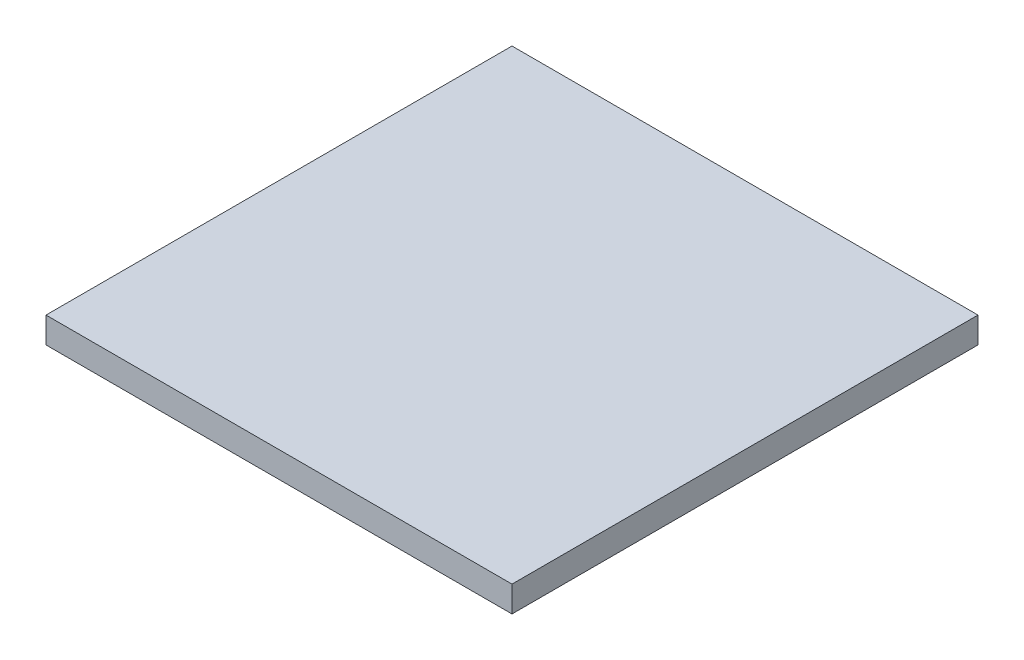
ISO-10303-21;
HEADER;
FILE_DESCRIPTION(('STEP AP214'),'2;1');
FILE_NAME('part.step','',(''),(''),'','','');
FILE_SCHEMA(('AUTOMOTIVE_DESIGN { 1 0 10303 214 1 1 1 1 }'));
ENDSEC;
DATA;
#1=APPLICATION_CONTEXT('core data for automotive mechanical design processes');
#2=APPLICATION_PROTOCOL_DEFINITION('international standard','automotive_design',2000,#1);
#3=PRODUCT_CONTEXT('',#1,'mechanical');
#4=PRODUCT('Part','Part','',(#3));
#5=PRODUCT_RELATED_PRODUCT_CATEGORY('part','',(#4));
#6=PRODUCT_DEFINITION_FORMATION('','',#4);
#7=PRODUCT_DEFINITION_CONTEXT('part definition',#1,'design');
#8=PRODUCT_DEFINITION('design','',#6,#7);
#9=PRODUCT_DEFINITION_SHAPE('','',#8);
#10=(LENGTH_UNIT() NAMED_UNIT(*) SI_UNIT(.MILLI.,.METRE.));
#11=(NAMED_UNIT(*) PLANE_ANGLE_UNIT() SI_UNIT($,.RADIAN.));
#12=(NAMED_UNIT(*) SI_UNIT($,.STERADIAN.) SOLID_ANGLE_UNIT());
#13=UNCERTAINTY_MEASURE_WITH_UNIT(LENGTH_MEASURE(1.E-05),#10,'distance_accuracy_value','');
#14=(GEOMETRIC_REPRESENTATION_CONTEXT(3) GLOBAL_UNCERTAINTY_ASSIGNED_CONTEXT((#13)) GLOBAL_UNIT_ASSIGNED_CONTEXT((#10,
#11,#12)) REPRESENTATION_CONTEXT('',''));
#15=CARTESIAN_POINT('',(0.,0.,0.));
#16=DIRECTION('',(0.,0.,1.));
#17=DIRECTION('',(1.,0.,0.));
#18=AXIS2_PLACEMENT_3D('',#15,#16,#17);
#19=CARTESIAN_POINT('',(-0.625,0.05,-0.625));
#20=DIRECTION('',(-0.707106781186548,0.,-0.707106781186548));
#21=DIRECTION('',(-0.707106781186548,0.,0.707106781186548));
#22=AXIS2_PLACEMENT_3D('',#19,#20,#21);
#23=PLANE('',#22);
#24=DIRECTION('',(-0.707106781186548,0.,0.707106781186548));
#25=VECTOR('',#24,1.);
#26=CARTESIAN_POINT('',(-0.45,0.1,-0.8));
#27=LINE('',#26,#25);
#28=CARTESIAN_POINT('',(-0.45,0.1,-0.8));
#29=VERTEX_POINT('',#28);
#30=CARTESIAN_POINT('',(-0.8,0.1,-0.45));
#31=VERTEX_POINT('',#30);
#32=EDGE_CURVE('E11',#29,#31,#27,.T.);
#33=ORIENTED_EDGE('',*,*,#32,.F.);
#34=DIRECTION('',(0.,1.,0.));
#35=VECTOR('',#34,1.);
#36=CARTESIAN_POINT('',(-0.45,0.,-0.8));
#37=LINE('',#36,#35);
#38=CARTESIAN_POINT('',(-0.45,0.,-0.8));
#39=VERTEX_POINT('',#38);
#40=EDGE_CURVE('E24',#39,#29,#37,.T.);
#41=ORIENTED_EDGE('',*,*,#40,.F.);
#42=DIRECTION('',(0.707106781186548,0.,-0.707106781186548));
#43=VECTOR('',#42,1.);
#44=CARTESIAN_POINT('',(-0.8,0.,-0.45));
#45=LINE('',#44,#43);
#46=CARTESIAN_POINT('',(-0.8,0.,-0.45));
#47=VERTEX_POINT('',#46);
#48=EDGE_CURVE('E156',#47,#39,#45,.T.);
#49=ORIENTED_EDGE('',*,*,#48,.F.);
#50=DIRECTION('',(0.,1.,0.));
#51=VECTOR('',#50,1.);
#52=CARTESIAN_POINT('',(-0.8,0.,-0.45));
#53=LINE('',#52,#51);
#54=EDGE_CURVE('E37',#47,#31,#53,.T.);
#55=ORIENTED_EDGE('',*,*,#54,.T.);
#56=EDGE_LOOP('',(#33,#41,#49,#55));
#57=FACE_BOUND('',#56,.T.);
#58=ADVANCED_FACE('F17',(#57),#23,.T.);
#59=CARTESIAN_POINT('',(-0.8,0.1,0.8));
#60=DIRECTION('',(-1.,0.,0.));
#61=DIRECTION('',(0.,0.,-1.));
#62=AXIS2_PLACEMENT_3D('',#59,#60,#61);
#63=PLANE('',#62);
#64=DIRECTION('',(0.,0.,-1.));
#65=VECTOR('',#64,1.);
#66=CARTESIAN_POINT('',(-0.8,0.,0.8));
#67=LINE('',#66,#65);
#68=CARTESIAN_POINT('',(-0.8,0.,0.8));
#69=VERTEX_POINT('',#68);
#70=EDGE_CURVE('E153',#69,#47,#67,.T.);
#71=ORIENTED_EDGE('',*,*,#70,.F.);
#72=DIRECTION('',(0.,-1.,0.));
#73=VECTOR('',#72,1.);
#74=CARTESIAN_POINT('',(-0.8,0.1,0.8));
#75=LINE('',#74,#73);
#76=CARTESIAN_POINT('',(-0.8,0.1,0.8));
#77=VERTEX_POINT('',#76);
#78=EDGE_CURVE('E93',#77,#69,#75,.T.);
#79=ORIENTED_EDGE('',*,*,#78,.F.);
#80=DIRECTION('',(0.,0.,-1.));
#81=VECTOR('',#80,1.);
#82=CARTESIAN_POINT('',(-0.8,0.1,0.8));
#83=LINE('',#82,#81);
#84=EDGE_CURVE('E149',#77,#31,#83,.T.);
#85=ORIENTED_EDGE('',*,*,#84,.T.);
#86=ORIENTED_EDGE('',*,*,#54,.F.);
#87=EDGE_LOOP('',(#71,#79,#85,#86));
#88=FACE_BOUND('',#87,.T.);
#89=ADVANCED_FACE('F162',(#88),#63,.T.);
#90=CARTESIAN_POINT('',(0.,0.1,0.));
#91=DIRECTION('',(0.,1.,0.));
#92=DIRECTION('',(1.,0.,0.));
#93=AXIS2_PLACEMENT_3D('',#90,#91,#92);
#94=PLANE('',#93);
#95=DIRECTION('',(-1.,0.,0.));
#96=VECTOR('',#95,1.);
#97=CARTESIAN_POINT('',(0.9,0.1,-0.9));
#98=LINE('',#97,#96);
#99=CARTESIAN_POINT('',(0.9,0.1,-0.9));
#100=VERTEX_POINT('',#99);
#101=CARTESIAN_POINT('',(-0.9,0.1,-0.9));
#102=VERTEX_POINT('',#101);
#103=EDGE_CURVE('E146',#100,#102,#98,.T.);
#104=ORIENTED_EDGE('',*,*,#103,.F.);
#105=DIRECTION('',(0.,0.,-1.));
#106=VECTOR('',#105,1.);
#107=CARTESIAN_POINT('',(0.9,0.1,0.9));
#108=LINE('',#107,#106);
#109=CARTESIAN_POINT('',(0.9,0.1,0.9));
#110=VERTEX_POINT('',#109);
#111=EDGE_CURVE('E144',#110,#100,#108,.T.);
#112=ORIENTED_EDGE('',*,*,#111,.F.);
#113=DIRECTION('',(1.,0.,0.));
#114=VECTOR('',#113,1.);
#115=CARTESIAN_POINT('',(-0.9,0.1,0.9));
#116=LINE('',#115,#114);
#117=CARTESIAN_POINT('',(-0.9,0.1,0.9));
#118=VERTEX_POINT('',#117);
#119=EDGE_CURVE('E142',#118,#110,#116,.T.);
#120=ORIENTED_EDGE('',*,*,#119,.F.);
#121=DIRECTION('',(0.,0.,1.));
#122=VECTOR('',#121,1.);
#123=CARTESIAN_POINT('',(-0.9,0.1,-0.9));
#124=LINE('',#123,#122);
#125=EDGE_CURVE('E140',#102,#118,#124,.T.);
#126=ORIENTED_EDGE('',*,*,#125,.F.);
#127=EDGE_LOOP('',(#104,#112,#120,#126));
#128=FACE_BOUND('',#127,.T.);
#129=DIRECTION('',(-1.,0.,0.));
#130=VECTOR('',#129,1.);
#131=CARTESIAN_POINT('',(0.8,0.1,0.8));
#132=LINE('',#131,#130);
#133=CARTESIAN_POINT('',(0.8,0.1,0.8));
#134=VERTEX_POINT('',#133);
#135=EDGE_CURVE('E138',#134,#77,#132,.T.);
#136=ORIENTED_EDGE('',*,*,#135,.F.);
#137=DIRECTION('',(0.,0.,1.));
#138=VECTOR('',#137,1.);
#139=CARTESIAN_POINT('',(0.8,0.1,-0.8));
#140=LINE('',#139,#138);
#141=CARTESIAN_POINT('',(0.8,0.1,-0.8));
#142=VERTEX_POINT('',#141);
#143=EDGE_CURVE('E108',#142,#134,#140,.T.);
#144=ORIENTED_EDGE('',*,*,#143,.F.);
#145=DIRECTION('',(1.,0.,0.));
#146=VECTOR('',#145,1.);
#147=CARTESIAN_POINT('',(-0.45,0.1,-0.8));
#148=LINE('',#147,#146);
#149=EDGE_CURVE('E135',#29,#142,#148,.T.);
#150=ORIENTED_EDGE('',*,*,#149,.F.);
#151=ORIENTED_EDGE('',*,*,#32,.T.);
#152=ORIENTED_EDGE('',*,*,#84,.F.);
#153=EDGE_LOOP('',(#136,#144,#150,#151,#152));
#154=FACE_BOUND('',#153,.T.);
#155=ADVANCED_FACE('F160',(#128,#154),#94,.F.);
#156=CARTESIAN_POINT('',(-0.9,0.1,-0.9));
#157=DIRECTION('',(-1.,0.,0.));
#158=DIRECTION('',(0.,0.,1.));
#159=AXIS2_PLACEMENT_3D('',#156,#157,#158);
#160=PLANE('',#159);
#161=DIRECTION('',(0.,1.,0.));
#162=VECTOR('',#161,1.);
#163=CARTESIAN_POINT('',(-0.9,0.1,0.9));
#164=LINE('',#163,#162);
#165=CARTESIAN_POINT('',(-0.9,0.2,0.9));
#166=VERTEX_POINT('',#165);
#167=EDGE_CURVE('E132',#118,#166,#164,.T.);
#168=ORIENTED_EDGE('',*,*,#167,.T.);
#169=DIRECTION('',(0.,0.,1.));
#170=VECTOR('',#169,1.);
#171=CARTESIAN_POINT('',(-0.9,0.2,-0.9));
#172=LINE('',#171,#170);
#173=CARTESIAN_POINT('',(-0.9,0.2,-0.9));
#174=VERTEX_POINT('',#173);
#175=EDGE_CURVE('E130',#174,#166,#172,.T.);
#176=ORIENTED_EDGE('',*,*,#175,.F.);
#177=DIRECTION('',(0.,1.,0.));
#178=VECTOR('',#177,1.);
#179=CARTESIAN_POINT('',(-0.9,0.1,-0.9));
#180=LINE('',#179,#178);
#181=EDGE_CURVE('E128',#102,#174,#180,.T.);
#182=ORIENTED_EDGE('',*,*,#181,.F.);
#183=ORIENTED_EDGE('',*,*,#125,.T.);
#184=EDGE_LOOP('',(#168,#176,#182,#183));
#185=FACE_BOUND('',#184,.T.);
#186=ADVANCED_FACE('F169',(#185),#160,.T.);
#187=CARTESIAN_POINT('',(0.9,0.1,-0.9));
#188=DIRECTION('',(0.,0.,-1.));
#189=DIRECTION('',(-1.,0.,0.));
#190=AXIS2_PLACEMENT_3D('',#187,#188,#189);
#191=PLANE('',#190);
#192=ORIENTED_EDGE('',*,*,#181,.T.);
#193=DIRECTION('',(-1.,0.,0.));
#194=VECTOR('',#193,1.);
#195=CARTESIAN_POINT('',(0.9,0.2,-0.9));
#196=LINE('',#195,#194);
#197=CARTESIAN_POINT('',(0.9,0.2,-0.9));
#198=VERTEX_POINT('',#197);
#199=EDGE_CURVE('E125',#198,#174,#196,.T.);
#200=ORIENTED_EDGE('',*,*,#199,.F.);
#201=DIRECTION('',(0.,1.,0.));
#202=VECTOR('',#201,1.);
#203=CARTESIAN_POINT('',(0.9,0.1,-0.9));
#204=LINE('',#203,#202);
#205=EDGE_CURVE('E123',#100,#198,#204,.T.);
#206=ORIENTED_EDGE('',*,*,#205,.F.);
#207=ORIENTED_EDGE('',*,*,#103,.T.);
#208=EDGE_LOOP('',(#192,#200,#206,#207));
#209=FACE_BOUND('',#208,.T.);
#210=ADVANCED_FACE('F175',(#209),#191,.T.);
#211=CARTESIAN_POINT('',(0.9,0.1,0.9));
#212=DIRECTION('',(1.,0.,0.));
#213=DIRECTION('',(0.,0.,-1.));
#214=AXIS2_PLACEMENT_3D('',#211,#212,#213);
#215=PLANE('',#214);
#216=ORIENTED_EDGE('',*,*,#205,.T.);
#217=DIRECTION('',(0.,0.,-1.));
#218=VECTOR('',#217,1.);
#219=CARTESIAN_POINT('',(0.9,0.2,0.9));
#220=LINE('',#219,#218);
#221=CARTESIAN_POINT('',(0.9,0.2,0.9));
#222=VERTEX_POINT('',#221);
#223=EDGE_CURVE('E120',#222,#198,#220,.T.);
#224=ORIENTED_EDGE('',*,*,#223,.F.);
#225=DIRECTION('',(0.,1.,0.));
#226=VECTOR('',#225,1.);
#227=CARTESIAN_POINT('',(0.9,0.1,0.9));
#228=LINE('',#227,#226);
#229=EDGE_CURVE('E118',#110,#222,#228,.T.);
#230=ORIENTED_EDGE('',*,*,#229,.F.);
#231=ORIENTED_EDGE('',*,*,#111,.T.);
#232=EDGE_LOOP('',(#216,#224,#230,#231));
#233=FACE_BOUND('',#232,.T.);
#234=ADVANCED_FACE('F179',(#233),#215,.T.);
#235=CARTESIAN_POINT('',(-0.9,0.1,0.9));
#236=DIRECTION('',(0.,0.,1.));
#237=DIRECTION('',(1.,0.,0.));
#238=AXIS2_PLACEMENT_3D('',#235,#236,#237);
#239=PLANE('',#238);
#240=ORIENTED_EDGE('',*,*,#229,.T.);
#241=DIRECTION('',(1.,0.,0.));
#242=VECTOR('',#241,1.);
#243=CARTESIAN_POINT('',(-0.9,0.2,0.9));
#244=LINE('',#243,#242);
#245=EDGE_CURVE('E115',#166,#222,#244,.T.);
#246=ORIENTED_EDGE('',*,*,#245,.F.);
#247=ORIENTED_EDGE('',*,*,#167,.F.);
#248=ORIENTED_EDGE('',*,*,#119,.T.);
#249=EDGE_LOOP('',(#240,#246,#247,#248));
#250=FACE_BOUND('',#249,.T.);
#251=ADVANCED_FACE('F183',(#250),#239,.T.);
#252=CARTESIAN_POINT('',(0.,0.2,0.));
#253=DIRECTION('',(0.,1.,0.));
#254=DIRECTION('',(1.,0.,0.));
#255=AXIS2_PLACEMENT_3D('',#252,#253,#254);
#256=PLANE('',#255);
#257=ORIENTED_EDGE('',*,*,#245,.T.);
#258=ORIENTED_EDGE('',*,*,#223,.T.);
#259=ORIENTED_EDGE('',*,*,#199,.T.);
#260=ORIENTED_EDGE('',*,*,#175,.T.);
#261=EDGE_LOOP('',(#257,#258,#259,#260));
#262=FACE_BOUND('',#261,.T.);
#263=ADVANCED_FACE('F187',(#262),#256,.T.);
#264=CARTESIAN_POINT('',(-0.8,0.1,-0.8));
#265=DIRECTION('',(0.,0.,-1.));
#266=DIRECTION('',(1.,0.,0.));
#267=AXIS2_PLACEMENT_3D('',#264,#265,#266);
#268=PLANE('',#267);
#269=ORIENTED_EDGE('',*,*,#149,.T.);
#270=DIRECTION('',(0.,-1.,0.));
#271=VECTOR('',#270,1.);
#272=CARTESIAN_POINT('',(0.8,0.1,-0.8));
#273=LINE('',#272,#271);
#274=CARTESIAN_POINT('',(0.8,0.,-0.8));
#275=VERTEX_POINT('',#274);
#276=EDGE_CURVE('E113',#142,#275,#273,.T.);
#277=ORIENTED_EDGE('',*,*,#276,.T.);
#278=DIRECTION('',(1.,0.,0.));
#279=VECTOR('',#278,1.);
#280=CARTESIAN_POINT('',(-0.45,0.,-0.8));
#281=LINE('',#280,#279);
#282=EDGE_CURVE('E101',#39,#275,#281,.T.);
#283=ORIENTED_EDGE('',*,*,#282,.F.);
#284=ORIENTED_EDGE('',*,*,#40,.T.);
#285=EDGE_LOOP('',(#269,#277,#283,#284));
#286=FACE_BOUND('',#285,.T.);
#287=ADVANCED_FACE('F158',(#286),#268,.T.);
#288=CARTESIAN_POINT('',(0.,0.,0.));
#289=DIRECTION('',(0.,-1.,0.));
#290=DIRECTION('',(-1.,0.,0.));
#291=AXIS2_PLACEMENT_3D('',#288,#289,#290);
#292=PLANE('',#291);
#293=ORIENTED_EDGE('',*,*,#282,.T.);
#294=DIRECTION('',(0.,0.,1.));
#295=VECTOR('',#294,1.);
#296=CARTESIAN_POINT('',(0.8,0.,-0.8));
#297=LINE('',#296,#295);
#298=CARTESIAN_POINT('',(0.8,0.,0.8));
#299=VERTEX_POINT('',#298);
#300=EDGE_CURVE('E97',#275,#299,#297,.T.);
#301=ORIENTED_EDGE('',*,*,#300,.T.);
#302=DIRECTION('',(-1.,0.,0.));
#303=VECTOR('',#302,1.);
#304=CARTESIAN_POINT('',(0.8,0.,0.8));
#305=LINE('',#304,#303);
#306=EDGE_CURVE('E86',#299,#69,#305,.T.);
#307=ORIENTED_EDGE('',*,*,#306,.T.);
#308=ORIENTED_EDGE('',*,*,#70,.T.);
#309=ORIENTED_EDGE('',*,*,#48,.T.);
#310=EDGE_LOOP('',(#293,#301,#307,#308,#309));
#311=FACE_BOUND('',#310,.T.);
#312=ADVANCED_FACE('F100',(#311),#292,.T.);
#313=CARTESIAN_POINT('',(0.8,0.1,0.8));
#314=DIRECTION('',(0.,0.,1.));
#315=DIRECTION('',(-1.,0.,0.));
#316=AXIS2_PLACEMENT_3D('',#313,#314,#315);
#317=PLANE('',#316);
#318=ORIENTED_EDGE('',*,*,#78,.T.);
#319=ORIENTED_EDGE('',*,*,#306,.F.);
#320=DIRECTION('',(0.,-1.,0.));
#321=VECTOR('',#320,1.);
#322=CARTESIAN_POINT('',(0.8,0.1,0.8));
#323=LINE('',#322,#321);
#324=EDGE_CURVE('E91',#134,#299,#323,.T.);
#325=ORIENTED_EDGE('',*,*,#324,.F.);
#326=ORIENTED_EDGE('',*,*,#135,.T.);
#327=EDGE_LOOP('',(#318,#319,#325,#326));
#328=FACE_BOUND('',#327,.T.);
#329=ADVANCED_FACE('F88',(#328),#317,.T.);
#330=CARTESIAN_POINT('',(0.8,0.1,-0.8));
#331=DIRECTION('',(1.,0.,0.));
#332=DIRECTION('',(0.,0.,1.));
#333=AXIS2_PLACEMENT_3D('',#330,#331,#332);
#334=PLANE('',#333);
#335=ORIENTED_EDGE('',*,*,#324,.T.);
#336=ORIENTED_EDGE('',*,*,#300,.F.);
#337=ORIENTED_EDGE('',*,*,#276,.F.);
#338=ORIENTED_EDGE('',*,*,#143,.T.);
#339=EDGE_LOOP('',(#335,#336,#337,#338));
#340=FACE_BOUND('',#339,.T.);
#341=ADVANCED_FACE('F106',(#340),#334,.T.);
#342=CLOSED_SHELL('',(#58,#89,#155,#186,#210,#234,#251,#263,#287,#312,#329,#341));
#343=MANIFOLD_SOLID_BREP('B1',#342);
#344=ADVANCED_BREP_SHAPE_REPRESENTATION('',(#18,#343),#14);
#345=SHAPE_DEFINITION_REPRESENTATION(#9,#344);
ENDSEC;
END-ISO-10303-21;
